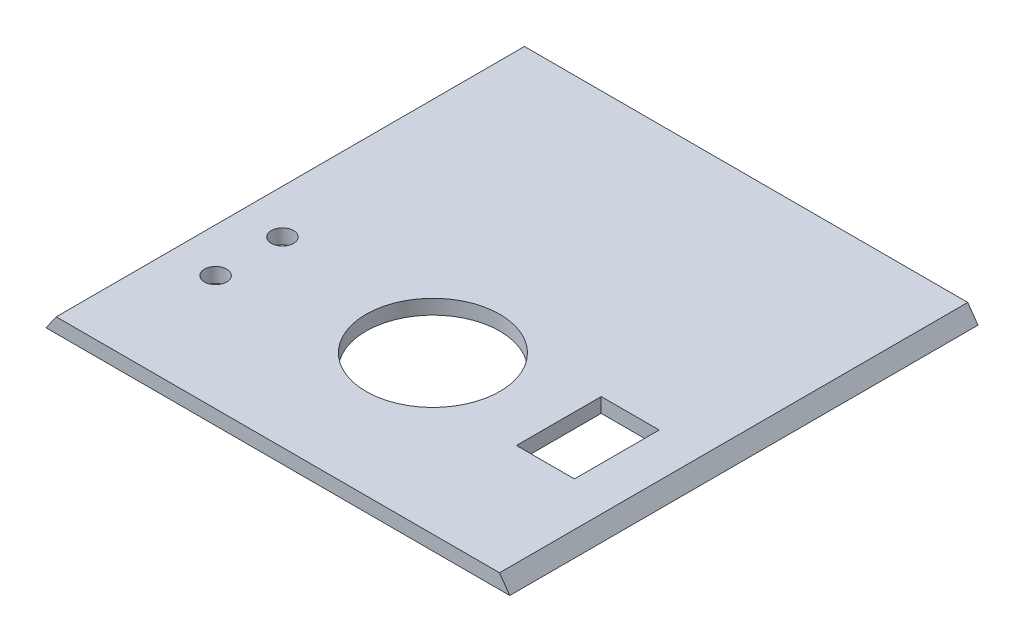
ISO-10303-21;
HEADER;
FILE_DESCRIPTION(('STEP AP214'),'2;1');
FILE_NAME('part.step','',(''),(''),'','','');
FILE_SCHEMA(('AUTOMOTIVE_DESIGN { 1 0 10303 214 1 1 1 1 }'));
ENDSEC;
DATA;
#1=APPLICATION_CONTEXT('core data for automotive mechanical design processes');
#2=APPLICATION_PROTOCOL_DEFINITION('international standard','automotive_design',2000,#1);
#3=PRODUCT_CONTEXT('',#1,'mechanical');
#4=PRODUCT('Part','Part','',(#3));
#5=PRODUCT_RELATED_PRODUCT_CATEGORY('part','',(#4));
#6=PRODUCT_DEFINITION_FORMATION('','',#4);
#7=PRODUCT_DEFINITION_CONTEXT('part definition',#1,'design');
#8=PRODUCT_DEFINITION('design','',#6,#7);
#9=PRODUCT_DEFINITION_SHAPE('','',#8);
#10=(LENGTH_UNIT() NAMED_UNIT(*) SI_UNIT(.MILLI.,.METRE.));
#11=(NAMED_UNIT(*) PLANE_ANGLE_UNIT() SI_UNIT($,.RADIAN.));
#12=(NAMED_UNIT(*) SI_UNIT($,.STERADIAN.) SOLID_ANGLE_UNIT());
#13=UNCERTAINTY_MEASURE_WITH_UNIT(LENGTH_MEASURE(1.E-05),#10,'distance_accuracy_value','');
#14=(GEOMETRIC_REPRESENTATION_CONTEXT(3) GLOBAL_UNCERTAINTY_ASSIGNED_CONTEXT((#13)) GLOBAL_UNIT_ASSIGNED_CONTEXT((#10,
#11,#12)) REPRESENTATION_CONTEXT('',''));
#15=CARTESIAN_POINT('',(0.,0.,0.));
#16=DIRECTION('',(0.,0.,1.));
#17=DIRECTION('',(1.,0.,0.));
#18=AXIS2_PLACEMENT_3D('',#15,#16,#17);
#19=CARTESIAN_POINT('',(-48.1684210526316,-4.92631578947369,-105.));
#20=DIRECTION('',(-0.819152044288994,0.573576436351043,0.));
#21=DIRECTION('',(-0.573576436351043,-0.819152044288994,0.));
#22=AXIS2_PLACEMENT_3D('',#19,#20,#21);
#23=PLANE('',#22);
#24=DIRECTION('',(-0.573576436351043,-0.819152044288994,0.));
#25=VECTOR('',#24,1.);
#26=CARTESIAN_POINT('',(-48.1684210526316,-4.92631578947369,0.));
#27=LINE('',#26,#25);
#28=CARTESIAN_POINT('',(-45.8741153072274,-1.64970761231772,0.));
#29=VERTEX_POINT('',#28);
#30=CARTESIAN_POINT('',(-48.1684210526316,-4.92631578947369,0.));
#31=VERTEX_POINT('',#30);
#32=EDGE_CURVE('E150',#29,#31,#27,.T.);
#33=ORIENTED_EDGE('',*,*,#32,.F.);
#34=DIRECTION('',(0.,0.,1.));
#35=VECTOR('',#34,1.);
#36=CARTESIAN_POINT('',(-45.8741153072274,-1.64970761231772,-105.));
#37=LINE('',#36,#35);
#38=CARTESIAN_POINT('',(-45.8741153072274,-1.64970761231772,-105.));
#39=VERTEX_POINT('',#38);
#40=EDGE_CURVE('E11',#39,#29,#37,.T.);
#41=ORIENTED_EDGE('',*,*,#40,.F.);
#42=DIRECTION('',(-0.573576436351043,-0.819152044288994,0.));
#43=VECTOR('',#42,1.);
#44=CARTESIAN_POINT('',(-48.1684210526316,-4.92631578947369,-105.));
#45=LINE('',#44,#43);
#46=CARTESIAN_POINT('',(-48.1684210526316,-4.92631578947369,-105.));
#47=VERTEX_POINT('',#46);
#48=EDGE_CURVE('E151',#39,#47,#45,.T.);
#49=ORIENTED_EDGE('',*,*,#48,.T.);
#50=DIRECTION('',(0.,0.,1.));
#51=VECTOR('',#50,1.);
#52=CARTESIAN_POINT('',(-48.1684210526316,-4.92631578947369,-105.));
#53=LINE('',#52,#51);
#54=EDGE_CURVE('E36',#47,#31,#53,.T.);
#55=ORIENTED_EDGE('',*,*,#54,.T.);
#56=EDGE_LOOP('',(#33,#41,#49,#55));
#57=FACE_BOUND('',#56,.T.);
#58=ADVANCED_FACE('F33',(#57),#23,.T.);
#59=CARTESIAN_POINT('',(-45.8741153072274,-1.64970761231772,-105.));
#60=DIRECTION('',(0.,1.,0.));
#61=DIRECTION('',(-1.,0.,0.));
#62=AXIS2_PLACEMENT_3D('',#59,#60,#61);
#63=PLANE('',#62);
#64=DIRECTION('',(0.,0.,1.));
#65=VECTOR('',#64,1.);
#66=CARTESIAN_POINT('',(30.7148251696532,-1.64970761231773,-26.6194204480767));
#67=LINE('',#66,#65);
#68=CARTESIAN_POINT('',(30.7148251696532,-1.64970761231773,-45.6194204480767));
#69=VERTEX_POINT('',#68);
#70=CARTESIAN_POINT('',(30.7148251696532,-1.64970761231773,-26.6194204480766));
#71=VERTEX_POINT('',#70);
#72=EDGE_CURVE('E49',#69,#71,#67,.T.);
#73=ORIENTED_EDGE('',*,*,#72,.F.);
#74=DIRECTION('',(-1.,0.,0.));
#75=VECTOR('',#74,1.);
#76=CARTESIAN_POINT('',(30.7148251696532,-1.64970761231773,-45.6194204480767));
#77=LINE('',#76,#75);
#78=CARTESIAN_POINT('',(43.7148251696532,-1.64970761231773,-45.6194204480767));
#79=VERTEX_POINT('',#78);
#80=EDGE_CURVE('E110',#79,#69,#77,.T.);
#81=ORIENTED_EDGE('',*,*,#80,.F.);
#82=DIRECTION('',(0.,0.,-1.));
#83=VECTOR('',#82,1.);
#84=CARTESIAN_POINT('',(43.7148251696532,-1.64970761231773,-26.6194204480767));
#85=LINE('',#84,#83);
#86=CARTESIAN_POINT('',(43.7148251696532,-1.64970761231773,-26.6194204480767));
#87=VERTEX_POINT('',#86);
#88=EDGE_CURVE('E124',#87,#79,#85,.T.);
#89=ORIENTED_EDGE('',*,*,#88,.F.);
#90=DIRECTION('',(1.,0.,0.));
#91=VECTOR('',#90,1.);
#92=CARTESIAN_POINT('',(30.7148251696532,-1.64970761231773,-26.6194204480767));
#93=LINE('',#92,#91);
#94=EDGE_CURVE('E117',#71,#87,#93,.T.);
#95=ORIENTED_EDGE('',*,*,#94,.F.);
#96=EDGE_LOOP('',(#73,#81,#89,#95));
#97=FACE_BOUND('',#96,.T.);
#98=CARTESIAN_POINT('',(-36.0169284448937,-1.64970761231772,-25.8751561430373));
#99=DIRECTION('',(0.,1.,0.));
#100=DIRECTION('',(-1.,0.,0.));
#101=AXIS2_PLACEMENT_3D('',#98,#99,#100);
#102=CIRCLE('',#101,2.5);
#103=CARTESIAN_POINT('',(-38.5169284448937,-1.64970761231772,-25.8751561430373));
#104=VERTEX_POINT('',#103);
#105=EDGE_CURVE('E141',#104,#104,#102,.F.);
#106=ORIENTED_EDGE('',*,*,#105,.T.);
#107=EDGE_LOOP('',(#106));
#108=FACE_BOUND('',#107,.T.);
#109=CARTESIAN_POINT('',(-36.0169284448937,-1.64970761231772,-40.8751561430373));
#110=DIRECTION('',(0.,1.,0.));
#111=DIRECTION('',(-1.,0.,0.));
#112=AXIS2_PLACEMENT_3D('',#109,#110,#111);
#113=CIRCLE('',#112,2.5);
#114=CARTESIAN_POINT('',(-38.5169284448937,-1.64970761231772,-40.8751561430373));
#115=VERTEX_POINT('',#114);
#116=EDGE_CURVE('E136',#115,#115,#113,.F.);
#117=ORIENTED_EDGE('',*,*,#116,.T.);
#118=EDGE_LOOP('',(#117));
#119=FACE_BOUND('',#118,.T.);
#120=CARTESIAN_POINT('',(3.36252497706151,-1.64970761231772,-35.2345269851534));
#121=DIRECTION('',(0.,1.,0.));
#122=DIRECTION('',(-1.,0.,0.));
#123=AXIS2_PLACEMENT_3D('',#120,#121,#122);
#124=CIRCLE('',#123,15.);
#125=CARTESIAN_POINT('',(-11.6374750229385,-1.64970761231772,-35.2345269851534));
#126=VERTEX_POINT('',#125);
#127=EDGE_CURVE('E147',#126,#126,#124,.T.);
#128=ORIENTED_EDGE('',*,*,#127,.F.);
#129=EDGE_LOOP('',(#128));
#130=FACE_BOUND('',#129,.T.);
#131=DIRECTION('',(-1.,0.,0.));
#132=VECTOR('',#131,1.);
#133=CARTESIAN_POINT('',(-45.8741153072274,-1.64970761231772,0.));
#134=LINE('',#133,#132);
#135=CARTESIAN_POINT('',(53.5372732019642,-1.64970761231773,0.));
#136=VERTEX_POINT('',#135);
#137=EDGE_CURVE('E155',#136,#29,#134,.T.);
#138=ORIENTED_EDGE('',*,*,#137,.F.);
#139=DIRECTION('',(0.,0.,1.));
#140=VECTOR('',#139,1.);
#141=CARTESIAN_POINT('',(53.5372732019642,-1.64970761231773,-105.));
#142=LINE('',#141,#140);
#143=CARTESIAN_POINT('',(53.5372732019642,-1.64970761231773,-105.));
#144=VERTEX_POINT('',#143);
#145=EDGE_CURVE('E41',#144,#136,#142,.T.);
#146=ORIENTED_EDGE('',*,*,#145,.F.);
#147=DIRECTION('',(-1.,0.,0.));
#148=VECTOR('',#147,1.);
#149=CARTESIAN_POINT('',(-45.8741153072274,-1.64970761231772,-105.));
#150=LINE('',#149,#148);
#151=EDGE_CURVE('E161',#144,#39,#150,.T.);
#152=ORIENTED_EDGE('',*,*,#151,.T.);
#153=ORIENTED_EDGE('',*,*,#40,.T.);
#154=EDGE_LOOP('',(#138,#146,#152,#153));
#155=FACE_BOUND('',#154,.T.);
#156=ADVANCED_FACE('F186',(#97,#108,#119,#130,#155),#63,.T.);
#157=CARTESIAN_POINT('',(55.8315789473684,-4.92631578947369,-105.));
#158=DIRECTION('',(0.819152044288989,0.57357643635105,0.));
#159=DIRECTION('',(-0.57357643635105,0.819152044288989,0.));
#160=AXIS2_PLACEMENT_3D('',#157,#158,#159);
#161=PLANE('',#160);
#162=DIRECTION('',(-0.57357643635105,0.819152044288989,0.));
#163=VECTOR('',#162,1.);
#164=CARTESIAN_POINT('',(55.8315789473684,-4.92631578947369,0.));
#165=LINE('',#164,#163);
#166=CARTESIAN_POINT('',(55.8315789473684,-4.92631578947369,0.));
#167=VERTEX_POINT('',#166);
#168=EDGE_CURVE('E169',#167,#136,#165,.T.);
#169=ORIENTED_EDGE('',*,*,#168,.F.);
#170=DIRECTION('',(0.,0.,1.));
#171=VECTOR('',#170,1.);
#172=CARTESIAN_POINT('',(55.8315789473684,-4.92631578947369,-105.));
#173=LINE('',#172,#171);
#174=CARTESIAN_POINT('',(55.8315789473684,-4.92631578947369,-105.));
#175=VERTEX_POINT('',#174);
#176=EDGE_CURVE('E174',#175,#167,#173,.T.);
#177=ORIENTED_EDGE('',*,*,#176,.F.);
#178=DIRECTION('',(-0.57357643635105,0.819152044288989,0.));
#179=VECTOR('',#178,1.);
#180=CARTESIAN_POINT('',(55.8315789473684,-4.92631578947369,-105.));
#181=LINE('',#180,#179);
#182=EDGE_CURVE('E158',#175,#144,#181,.T.);
#183=ORIENTED_EDGE('',*,*,#182,.T.);
#184=ORIENTED_EDGE('',*,*,#145,.T.);
#185=EDGE_LOOP('',(#169,#177,#183,#184));
#186=FACE_BOUND('',#185,.T.);
#187=ADVANCED_FACE('F192',(#186),#161,.T.);
#188=CARTESIAN_POINT('',(-48.1684210526316,-4.92631578947369,-105.));
#189=DIRECTION('',(0.,-1.,0.));
#190=DIRECTION('',(0.,0.,-1.));
#191=AXIS2_PLACEMENT_3D('',#188,#189,#190);
#192=PLANE('',#191);
#193=DIRECTION('',(0.,0.,1.));
#194=VECTOR('',#193,1.);
#195=CARTESIAN_POINT('',(30.7148251696532,-4.92631578947369,-26.6194204480767));
#196=LINE('',#195,#194);
#197=CARTESIAN_POINT('',(30.7148251696532,-4.92631578947369,-45.6194204480767));
#198=VERTEX_POINT('',#197);
#199=CARTESIAN_POINT('',(30.7148251696532,-4.92631578947369,-26.6194204480767));
#200=VERTEX_POINT('',#199);
#201=EDGE_CURVE('E108',#198,#200,#196,.T.);
#202=ORIENTED_EDGE('',*,*,#201,.T.);
#203=DIRECTION('',(1.,0.,0.));
#204=VECTOR('',#203,1.);
#205=CARTESIAN_POINT('',(30.7148251696532,-4.92631578947369,-26.6194204480767));
#206=LINE('',#205,#204);
#207=CARTESIAN_POINT('',(43.7148251696532,-4.92631578947369,-26.6194204480766));
#208=VERTEX_POINT('',#207);
#209=EDGE_CURVE('E97',#200,#208,#206,.T.);
#210=ORIENTED_EDGE('',*,*,#209,.T.);
#211=DIRECTION('',(0.,0.,-1.));
#212=VECTOR('',#211,1.);
#213=CARTESIAN_POINT('',(43.7148251696532,-4.92631578947369,-26.6194204480767));
#214=LINE('',#213,#212);
#215=CARTESIAN_POINT('',(43.7148251696532,-4.92631578947369,-45.6194204480767));
#216=VERTEX_POINT('',#215);
#217=EDGE_CURVE('E119',#208,#216,#214,.T.);
#218=ORIENTED_EDGE('',*,*,#217,.T.);
#219=DIRECTION('',(-1.,0.,0.));
#220=VECTOR('',#219,1.);
#221=CARTESIAN_POINT('',(30.7148251696532,-4.92631578947369,-45.6194204480767));
#222=LINE('',#221,#220);
#223=EDGE_CURVE('E115',#216,#198,#222,.T.);
#224=ORIENTED_EDGE('',*,*,#223,.T.);
#225=EDGE_LOOP('',(#202,#210,#218,#224));
#226=FACE_BOUND('',#225,.T.);
#227=CARTESIAN_POINT('',(-36.0169284448937,-4.92631578947369,-25.8751561430373));
#228=DIRECTION('',(0.,-1.,0.));
#229=DIRECTION('',(0.,0.,-1.));
#230=AXIS2_PLACEMENT_3D('',#227,#228,#229);
#231=CIRCLE('',#230,2.5);
#232=CARTESIAN_POINT('',(-36.0169284448937,-4.92631578947369,-28.3751561430373));
#233=VERTEX_POINT('',#232);
#234=EDGE_CURVE('E133',#233,#233,#231,.F.);
#235=ORIENTED_EDGE('',*,*,#234,.T.);
#236=EDGE_LOOP('',(#235));
#237=FACE_BOUND('',#236,.T.);
#238=CARTESIAN_POINT('',(-36.0169284448937,-4.92631578947369,-40.8751561430373));
#239=DIRECTION('',(0.,-1.,0.));
#240=DIRECTION('',(0.,0.,-1.));
#241=AXIS2_PLACEMENT_3D('',#238,#239,#240);
#242=CIRCLE('',#241,2.5);
#243=CARTESIAN_POINT('',(-36.0169284448937,-4.92631578947369,-43.3751561430373));
#244=VERTEX_POINT('',#243);
#245=EDGE_CURVE('E104',#244,#244,#242,.F.);
#246=ORIENTED_EDGE('',*,*,#245,.T.);
#247=EDGE_LOOP('',(#246));
#248=FACE_BOUND('',#247,.T.);
#249=CARTESIAN_POINT('',(3.36252497706151,-4.9263157894737,-35.2345269851534));
#250=DIRECTION('',(0.,1.,0.));
#251=DIRECTION('',(-1.,0.,0.));
#252=AXIS2_PLACEMENT_3D('',#249,#250,#251);
#253=CIRCLE('',#252,15.);
#254=CARTESIAN_POINT('',(-11.6374750229385,-4.92631578947369,-35.2345269851534));
#255=VERTEX_POINT('',#254);
#256=EDGE_CURVE('E144',#255,#255,#253,.T.);
#257=ORIENTED_EDGE('',*,*,#256,.T.);
#258=EDGE_LOOP('',(#257));
#259=FACE_BOUND('',#258,.T.);
#260=DIRECTION('',(1.,0.,0.));
#261=VECTOR('',#260,1.);
#262=CARTESIAN_POINT('',(-48.1684210526316,-4.92631578947369,0.));
#263=LINE('',#262,#261);
#264=EDGE_CURVE('E166',#31,#167,#263,.T.);
#265=ORIENTED_EDGE('',*,*,#264,.F.);
#266=ORIENTED_EDGE('',*,*,#54,.F.);
#267=DIRECTION('',(1.,0.,0.));
#268=VECTOR('',#267,1.);
#269=CARTESIAN_POINT('',(-48.1684210526316,-4.92631578947369,-105.));
#270=LINE('',#269,#268);
#271=EDGE_CURVE('E154',#47,#175,#270,.T.);
#272=ORIENTED_EDGE('',*,*,#271,.T.);
#273=ORIENTED_EDGE('',*,*,#176,.T.);
#274=EDGE_LOOP('',(#265,#266,#272,#273));
#275=FACE_BOUND('',#274,.T.);
#276=ADVANCED_FACE('F113',(#226,#237,#248,#259,#275),#192,.T.);
#277=CARTESIAN_POINT('',(0.,0.,-105.));
#278=DIRECTION('',(0.,0.,1.));
#279=DIRECTION('',(1.,0.,0.));
#280=AXIS2_PLACEMENT_3D('',#277,#278,#279);
#281=PLANE('',#280);
#282=ORIENTED_EDGE('',*,*,#48,.F.);
#283=ORIENTED_EDGE('',*,*,#151,.F.);
#284=ORIENTED_EDGE('',*,*,#182,.F.);
#285=ORIENTED_EDGE('',*,*,#271,.F.);
#286=EDGE_LOOP('',(#282,#283,#284,#285));
#287=FACE_BOUND('',#286,.T.);
#288=ADVANCED_FACE('F189',(#287),#281,.F.);
#289=CARTESIAN_POINT('',(0.,0.,0.));
#290=DIRECTION('',(0.,0.,1.));
#291=DIRECTION('',(1.,0.,0.));
#292=AXIS2_PLACEMENT_3D('',#289,#290,#291);
#293=PLANE('',#292);
#294=ORIENTED_EDGE('',*,*,#32,.T.);
#295=ORIENTED_EDGE('',*,*,#264,.T.);
#296=ORIENTED_EDGE('',*,*,#168,.T.);
#297=ORIENTED_EDGE('',*,*,#137,.T.);
#298=EDGE_LOOP('',(#294,#295,#296,#297));
#299=FACE_BOUND('',#298,.T.);
#300=ADVANCED_FACE('F183',(#299),#293,.T.);
#301=CARTESIAN_POINT('',(3.36252497706151,-4.9263157894737,-35.2345269851534));
#302=DIRECTION('',(0.,1.,0.));
#303=DIRECTION('',(-1.,0.,0.));
#304=AXIS2_PLACEMENT_3D('',#301,#302,#303);
#305=CYLINDRICAL_SURFACE('',#304,15.);
#306=ORIENTED_EDGE('',*,*,#127,.T.);
#307=EDGE_LOOP('',(#306));
#308=FACE_BOUND('',#307,.T.);
#309=ORIENTED_EDGE('',*,*,#256,.F.);
#310=EDGE_LOOP('',(#309));
#311=FACE_BOUND('',#310,.T.);
#312=ADVANCED_FACE('F269',(#308,#311),#305,.F.);
#313=CARTESIAN_POINT('',(-36.0169284448937,-1.64969561231772,-40.8751561430373));
#314=DIRECTION('',(0.,-1.,0.));
#315=DIRECTION('',(1.,0.,0.));
#316=AXIS2_PLACEMENT_3D('',#313,#314,#315);
#317=CYLINDRICAL_SURFACE('',#316,2.5);
#318=ORIENTED_EDGE('',*,*,#116,.F.);
#319=EDGE_LOOP('',(#318));
#320=FACE_BOUND('',#319,.T.);
#321=ORIENTED_EDGE('',*,*,#245,.F.);
#322=EDGE_LOOP('',(#321));
#323=FACE_BOUND('',#322,.T.);
#324=ADVANCED_FACE('F265',(#320,#323),#317,.F.);
#325=CARTESIAN_POINT('',(-36.0169284448937,-1.64969561231772,-25.8751561430373));
#326=DIRECTION('',(0.,-1.,0.));
#327=DIRECTION('',(1.,0.,0.));
#328=AXIS2_PLACEMENT_3D('',#325,#326,#327);
#329=CYLINDRICAL_SURFACE('',#328,2.5);
#330=ORIENTED_EDGE('',*,*,#105,.F.);
#331=EDGE_LOOP('',(#330));
#332=FACE_BOUND('',#331,.T.);
#333=ORIENTED_EDGE('',*,*,#234,.F.);
#334=EDGE_LOOP('',(#333));
#335=FACE_BOUND('',#334,.T.);
#336=ADVANCED_FACE('F215',(#332,#335),#329,.F.);
#337=CARTESIAN_POINT('',(30.7148251696532,-4.92731578947371,-26.6194204480767));
#338=DIRECTION('',(-1.,0.,0.));
#339=DIRECTION('',(0.,-1.,0.));
#340=AXIS2_PLACEMENT_3D('',#337,#338,#339);
#341=PLANE('',#340);
#342=DIRECTION('',(0.,1.,0.));
#343=VECTOR('',#342,1.);
#344=CARTESIAN_POINT('',(30.7148251696532,-4.92731578947371,-45.6194204480767));
#345=LINE('',#344,#343);
#346=EDGE_CURVE('E105',#198,#69,#345,.T.);
#347=ORIENTED_EDGE('',*,*,#346,.T.);
#348=ORIENTED_EDGE('',*,*,#72,.T.);
#349=DIRECTION('',(0.,1.,0.));
#350=VECTOR('',#349,1.);
#351=CARTESIAN_POINT('',(30.7148251696532,-4.92731578947371,-26.6194204480767));
#352=LINE('',#351,#350);
#353=EDGE_CURVE('E99',#200,#71,#352,.T.);
#354=ORIENTED_EDGE('',*,*,#353,.F.);
#355=ORIENTED_EDGE('',*,*,#201,.F.);
#356=EDGE_LOOP('',(#347,#348,#354,#355));
#357=FACE_BOUND('',#356,.T.);
#358=ADVANCED_FACE('F107',(#357),#341,.F.);
#359=CARTESIAN_POINT('',(30.7148251696532,-4.92731578947371,-45.6194204480767));
#360=DIRECTION('',(0.,0.,-1.));
#361=DIRECTION('',(-1.,0.,0.));
#362=AXIS2_PLACEMENT_3D('',#359,#360,#361);
#363=PLANE('',#362);
#364=DIRECTION('',(0.,1.,0.));
#365=VECTOR('',#364,1.);
#366=CARTESIAN_POINT('',(43.7148251696532,-4.92731578947371,-45.6194204480767));
#367=LINE('',#366,#365);
#368=EDGE_CURVE('E130',#216,#79,#367,.T.);
#369=ORIENTED_EDGE('',*,*,#368,.T.);
#370=ORIENTED_EDGE('',*,*,#80,.T.);
#371=ORIENTED_EDGE('',*,*,#346,.F.);
#372=ORIENTED_EDGE('',*,*,#223,.F.);
#373=EDGE_LOOP('',(#369,#370,#371,#372));
#374=FACE_BOUND('',#373,.T.);
#375=ADVANCED_FACE('F232',(#374),#363,.F.);
#376=CARTESIAN_POINT('',(43.7148251696532,-4.92731578947371,-26.6194204480767));
#377=DIRECTION('',(1.,0.,0.));
#378=DIRECTION('',(0.,1.,0.));
#379=AXIS2_PLACEMENT_3D('',#376,#377,#378);
#380=PLANE('',#379);
#381=DIRECTION('',(0.,1.,0.));
#382=VECTOR('',#381,1.);
#383=CARTESIAN_POINT('',(43.7148251696532,-4.92731578947371,-26.6194204480767));
#384=LINE('',#383,#382);
#385=EDGE_CURVE('E57',#208,#87,#384,.T.);
#386=ORIENTED_EDGE('',*,*,#385,.T.);
#387=ORIENTED_EDGE('',*,*,#88,.T.);
#388=ORIENTED_EDGE('',*,*,#368,.F.);
#389=ORIENTED_EDGE('',*,*,#217,.F.);
#390=EDGE_LOOP('',(#386,#387,#388,#389));
#391=FACE_BOUND('',#390,.T.);
#392=ADVANCED_FACE('F241',(#391),#380,.F.);
#393=CARTESIAN_POINT('',(30.7148251696532,-4.92731578947371,-26.6194204480767));
#394=DIRECTION('',(0.,0.,1.));
#395=DIRECTION('',(1.,0.,0.));
#396=AXIS2_PLACEMENT_3D('',#393,#394,#395);
#397=PLANE('',#396);
#398=ORIENTED_EDGE('',*,*,#353,.T.);
#399=ORIENTED_EDGE('',*,*,#94,.T.);
#400=ORIENTED_EDGE('',*,*,#385,.F.);
#401=ORIENTED_EDGE('',*,*,#209,.F.);
#402=EDGE_LOOP('',(#398,#399,#400,#401));
#403=FACE_BOUND('',#402,.T.);
#404=ADVANCED_FACE('F98',(#403),#397,.F.);
#405=CLOSED_SHELL('',(#58,#156,#187,#276,#288,#300,#312,#324,#336,#358,#375,#392,#404));
#406=MANIFOLD_SOLID_BREP('B2',#405);
#407=ADVANCED_BREP_SHAPE_REPRESENTATION('',(#18,#406),#14);
#408=SHAPE_DEFINITION_REPRESENTATION(#9,#407);
ENDSEC;
END-ISO-10303-21;
